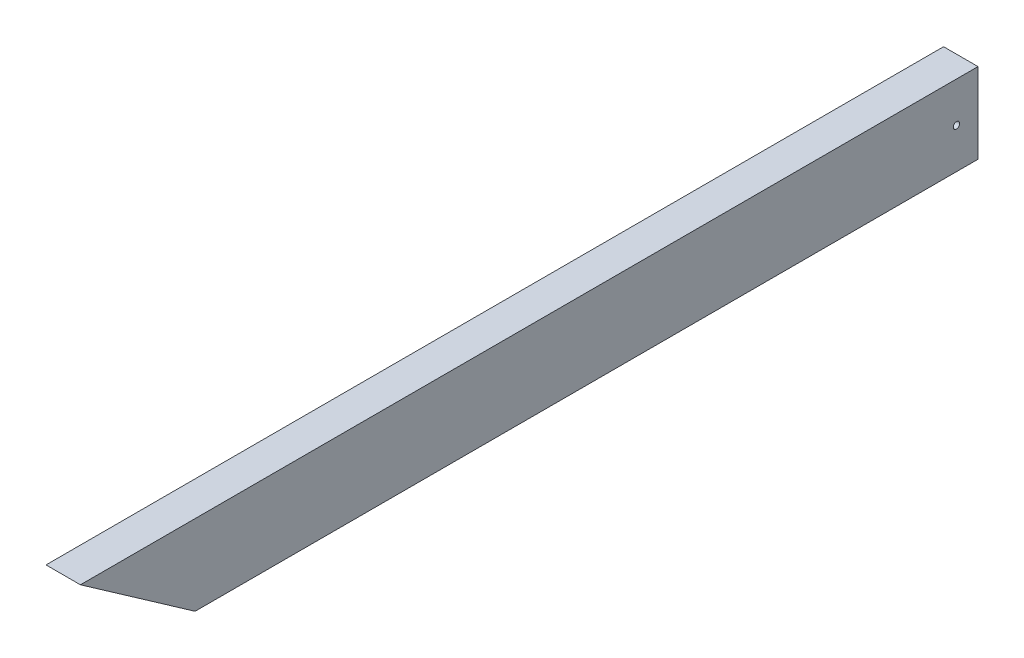
ISO-10303-21;
HEADER;
FILE_DESCRIPTION(('STEP AP214'),'2;1');
FILE_NAME('part.step','',(''),(''),'','','');
FILE_SCHEMA(('AUTOMOTIVE_DESIGN { 1 0 10303 214 1 1 1 1 }'));
ENDSEC;
DATA;
#1=APPLICATION_CONTEXT('core data for automotive mechanical design processes');
#2=APPLICATION_PROTOCOL_DEFINITION('international standard','automotive_design',2000,#1);
#3=PRODUCT_CONTEXT('',#1,'mechanical');
#4=PRODUCT('Part','Part','',(#3));
#5=PRODUCT_RELATED_PRODUCT_CATEGORY('part','',(#4));
#6=PRODUCT_DEFINITION_FORMATION('','',#4);
#7=PRODUCT_DEFINITION_CONTEXT('part definition',#1,'design');
#8=PRODUCT_DEFINITION('design','',#6,#7);
#9=PRODUCT_DEFINITION_SHAPE('','',#8);
#10=(LENGTH_UNIT() NAMED_UNIT(*) SI_UNIT(.MILLI.,.METRE.));
#11=(NAMED_UNIT(*) PLANE_ANGLE_UNIT() SI_UNIT($,.RADIAN.));
#12=(NAMED_UNIT(*) SI_UNIT($,.STERADIAN.) SOLID_ANGLE_UNIT());
#13=UNCERTAINTY_MEASURE_WITH_UNIT(LENGTH_MEASURE(1.E-05),#10,'distance_accuracy_value','');
#14=(GEOMETRIC_REPRESENTATION_CONTEXT(3) GLOBAL_UNCERTAINTY_ASSIGNED_CONTEXT((#13)) GLOBAL_UNIT_ASSIGNED_CONTEXT((#10,
#11,#12)) REPRESENTATION_CONTEXT('',''));
#15=CARTESIAN_POINT('',(0.,0.,0.));
#16=DIRECTION('',(0.,0.,1.));
#17=DIRECTION('',(1.,0.,0.));
#18=AXIS2_PLACEMENT_3D('',#15,#16,#17);
#19=CARTESIAN_POINT('',(19.05,-44.45,1143.));
#20=DIRECTION('',(-1.,0.,0.));
#21=DIRECTION('',(0.,0.,1.));
#22=AXIS2_PLACEMENT_3D('',#19,#20,#21);
#23=PLANE('',#22);
#24=CARTESIAN_POINT('',(19.05,0.,23.8125));
#25=DIRECTION('',(1.,0.,0.));
#26=DIRECTION('',(0.,0.,-1.));
#27=AXIS2_PLACEMENT_3D('',#24,#25,#26);
#28=CIRCLE('',#27,3.571875);
#29=CARTESIAN_POINT('',(19.05,0.,20.240625));
#30=VERTEX_POINT('',#29);
#31=EDGE_CURVE('E119',#30,#30,#28,.T.);
#32=ORIENTED_EDGE('',*,*,#31,.F.);
#33=EDGE_LOOP('',(#32));
#34=FACE_BOUND('',#33,.T.);
#35=DIRECTION('',(0.,-0.573576436351044,-0.819152044288993));
#36=VECTOR('',#35,1.);
#37=CARTESIAN_POINT('',(19.05,-437.095119425344,306.057297536298));
#38=LINE('',#37,#36);
#39=CARTESIAN_POINT('',(19.05,44.4499999999999,993.775));
#40=VERTEX_POINT('',#39);
#41=CARTESIAN_POINT('',(19.05,-44.45,866.812642200626));
#42=VERTEX_POINT('',#41);
#43=EDGE_CURVE('E78',#40,#42,#38,.T.);
#44=ORIENTED_EDGE('',*,*,#43,.T.);
#45=DIRECTION('',(0.,0.,-1.));
#46=VECTOR('',#45,1.);
#47=CARTESIAN_POINT('',(19.05,-44.45,1143.));
#48=LINE('',#47,#46);
#49=CARTESIAN_POINT('',(19.05,-44.45,0.));
#50=VERTEX_POINT('',#49);
#51=EDGE_CURVE('E59',#42,#50,#48,.T.);
#52=ORIENTED_EDGE('',*,*,#51,.T.);
#53=DIRECTION('',(0.,1.,0.));
#54=VECTOR('',#53,1.);
#55=CARTESIAN_POINT('',(19.05,-44.45,0.));
#56=LINE('',#55,#54);
#57=CARTESIAN_POINT('',(19.05,44.45,0.));
#58=VERTEX_POINT('',#57);
#59=EDGE_CURVE('E112',#50,#58,#56,.T.);
#60=ORIENTED_EDGE('',*,*,#59,.T.);
#61=DIRECTION('',(0.,0.,-1.));
#62=VECTOR('',#61,1.);
#63=CARTESIAN_POINT('',(19.05,44.45,1143.));
#64=LINE('',#63,#62);
#65=EDGE_CURVE('E11',#40,#58,#64,.T.);
#66=ORIENTED_EDGE('',*,*,#65,.F.);
#67=EDGE_LOOP('',(#44,#52,#60,#66));
#68=FACE_BOUND('',#67,.T.);
#69=ADVANCED_FACE('F36',(#34,#68),#23,.F.);
#70=CARTESIAN_POINT('',(-19.05,44.45,1143.));
#71=DIRECTION('',(0.,-1.,0.));
#72=DIRECTION('',(0.,0.,-1.));
#73=AXIS2_PLACEMENT_3D('',#70,#71,#72);
#74=PLANE('',#73);
#75=DIRECTION('',(1.,0.,0.));
#76=VECTOR('',#75,1.);
#77=CARTESIAN_POINT('',(-19.05,44.4499999999999,993.775));
#78=LINE('',#77,#76);
#79=CARTESIAN_POINT('',(-19.05,44.4499999999999,993.775));
#80=VERTEX_POINT('',#79);
#81=EDGE_CURVE('E76',#80,#40,#78,.T.);
#82=ORIENTED_EDGE('',*,*,#81,.T.);
#83=ORIENTED_EDGE('',*,*,#65,.T.);
#84=DIRECTION('',(-1.,0.,0.));
#85=VECTOR('',#84,1.);
#86=CARTESIAN_POINT('',(-19.05,44.45,0.));
#87=LINE('',#86,#85);
#88=CARTESIAN_POINT('',(-19.05,44.45,0.));
#89=VERTEX_POINT('',#88);
#90=EDGE_CURVE('E95',#58,#89,#87,.T.);
#91=ORIENTED_EDGE('',*,*,#90,.T.);
#92=DIRECTION('',(0.,0.,-1.));
#93=VECTOR('',#92,1.);
#94=CARTESIAN_POINT('',(-19.05,44.45,1143.));
#95=LINE('',#94,#93);
#96=EDGE_CURVE('E44',#80,#89,#95,.T.);
#97=ORIENTED_EDGE('',*,*,#96,.F.);
#98=EDGE_LOOP('',(#82,#83,#91,#97));
#99=FACE_BOUND('',#98,.T.);
#100=ADVANCED_FACE('F93',(#99),#74,.F.);
#101=CARTESIAN_POINT('',(-19.05,-44.45,1143.));
#102=DIRECTION('',(1.,0.,0.));
#103=DIRECTION('',(0.,0.,-1.));
#104=AXIS2_PLACEMENT_3D('',#101,#102,#103);
#105=PLANE('',#104);
#106=CARTESIAN_POINT('',(-19.05,0.,23.8125));
#107=DIRECTION('',(1.,0.,0.));
#108=DIRECTION('',(0.,0.,-1.));
#109=AXIS2_PLACEMENT_3D('',#106,#107,#108);
#110=CIRCLE('',#109,3.57187499999999);
#111=CARTESIAN_POINT('',(-19.05,0.,20.240625));
#112=VERTEX_POINT('',#111);
#113=EDGE_CURVE('E115',#112,#112,#110,.T.);
#114=ORIENTED_EDGE('',*,*,#113,.T.);
#115=EDGE_LOOP('',(#114));
#116=FACE_BOUND('',#115,.T.);
#117=DIRECTION('',(0.,-0.573576436351044,-0.819152044288993));
#118=VECTOR('',#117,1.);
#119=CARTESIAN_POINT('',(-19.05,-437.095119425344,306.057297536298));
#120=LINE('',#119,#118);
#121=CARTESIAN_POINT('',(-19.05,-44.45,866.812642200626));
#122=VERTEX_POINT('',#121);
#123=EDGE_CURVE('E51',#80,#122,#120,.T.);
#124=ORIENTED_EDGE('',*,*,#123,.F.);
#125=ORIENTED_EDGE('',*,*,#96,.T.);
#126=DIRECTION('',(0.,-1.,0.));
#127=VECTOR('',#126,1.);
#128=CARTESIAN_POINT('',(-19.05,-44.45,0.));
#129=LINE('',#128,#127);
#130=CARTESIAN_POINT('',(-19.05,-44.45,0.));
#131=VERTEX_POINT('',#130);
#132=EDGE_CURVE('E107',#89,#131,#129,.T.);
#133=ORIENTED_EDGE('',*,*,#132,.T.);
#134=DIRECTION('',(0.,0.,-1.));
#135=VECTOR('',#134,1.);
#136=CARTESIAN_POINT('',(-19.05,-44.45,1143.));
#137=LINE('',#136,#135);
#138=EDGE_CURVE('E90',#122,#131,#137,.T.);
#139=ORIENTED_EDGE('',*,*,#138,.F.);
#140=EDGE_LOOP('',(#124,#125,#133,#139));
#141=FACE_BOUND('',#140,.T.);
#142=ADVANCED_FACE('F87',(#116,#141),#105,.F.);
#143=CARTESIAN_POINT('',(-19.05,-44.45,1143.));
#144=DIRECTION('',(0.,1.,0.));
#145=DIRECTION('',(0.,0.,1.));
#146=AXIS2_PLACEMENT_3D('',#143,#144,#145);
#147=PLANE('',#146);
#148=DIRECTION('',(1.,0.,0.));
#149=VECTOR('',#148,1.);
#150=CARTESIAN_POINT('',(-19.05,-44.45,866.812642200626));
#151=LINE('',#150,#149);
#152=EDGE_CURVE('E83',#122,#42,#151,.T.);
#153=ORIENTED_EDGE('',*,*,#152,.F.);
#154=ORIENTED_EDGE('',*,*,#138,.T.);
#155=DIRECTION('',(1.,0.,0.));
#156=VECTOR('',#155,1.);
#157=CARTESIAN_POINT('',(-19.05,-44.45,0.));
#158=LINE('',#157,#156);
#159=EDGE_CURVE('E104',#131,#50,#158,.T.);
#160=ORIENTED_EDGE('',*,*,#159,.T.);
#161=ORIENTED_EDGE('',*,*,#51,.F.);
#162=EDGE_LOOP('',(#153,#154,#160,#161));
#163=FACE_BOUND('',#162,.T.);
#164=ADVANCED_FACE('F128',(#163),#147,.F.);
#165=CARTESIAN_POINT('',(0.,0.,0.));
#166=DIRECTION('',(0.,0.,-1.));
#167=DIRECTION('',(-1.,0.,0.));
#168=AXIS2_PLACEMENT_3D('',#165,#166,#167);
#169=PLANE('',#168);
#170=ORIENTED_EDGE('',*,*,#59,.F.);
#171=ORIENTED_EDGE('',*,*,#159,.F.);
#172=ORIENTED_EDGE('',*,*,#132,.F.);
#173=ORIENTED_EDGE('',*,*,#90,.F.);
#174=EDGE_LOOP('',(#170,#171,#172,#173));
#175=FACE_BOUND('',#174,.T.);
#176=ADVANCED_FACE('F132',(#175),#169,.T.);
#177=CARTESIAN_POINT('',(19.05,0.,23.8125));
#178=DIRECTION('',(1.,0.,0.));
#179=DIRECTION('',(0.,0.,-1.));
#180=AXIS2_PLACEMENT_3D('',#177,#178,#179);
#181=CYLINDRICAL_SURFACE('',#180,3.57187499999999);
#182=ORIENTED_EDGE('',*,*,#113,.F.);
#183=EDGE_LOOP('',(#182));
#184=FACE_BOUND('',#183,.T.);
#185=ORIENTED_EDGE('',*,*,#31,.T.);
#186=EDGE_LOOP('',(#185));
#187=FACE_BOUND('',#186,.T.);
#188=ADVANCED_FACE('F134',(#184,#187),#181,.F.);
#189=CARTESIAN_POINT('',(-19.05,-437.095119425344,306.057297536298));
#190=DIRECTION('',(0.,-0.819152044288993,0.573576436351044));
#191=DIRECTION('',(0.,-0.573576436351044,-0.819152044288993));
#192=AXIS2_PLACEMENT_3D('',#189,#190,#191);
#193=PLANE('',#192);
#194=ORIENTED_EDGE('',*,*,#43,.F.);
#195=ORIENTED_EDGE('',*,*,#81,.F.);
#196=ORIENTED_EDGE('',*,*,#123,.T.);
#197=ORIENTED_EDGE('',*,*,#152,.T.);
#198=EDGE_LOOP('',(#194,#195,#196,#197));
#199=FACE_BOUND('',#198,.T.);
#200=ADVANCED_FACE('F77',(#199),#193,.T.);
#201=CLOSED_SHELL('',(#69,#100,#142,#164,#176,#188,#200));
#202=MANIFOLD_SOLID_BREP('B2',#201);
#203=ADVANCED_BREP_SHAPE_REPRESENTATION('',(#18,#202),#14);
#204=SHAPE_DEFINITION_REPRESENTATION(#9,#203);
ENDSEC;
END-ISO-10303-21;
